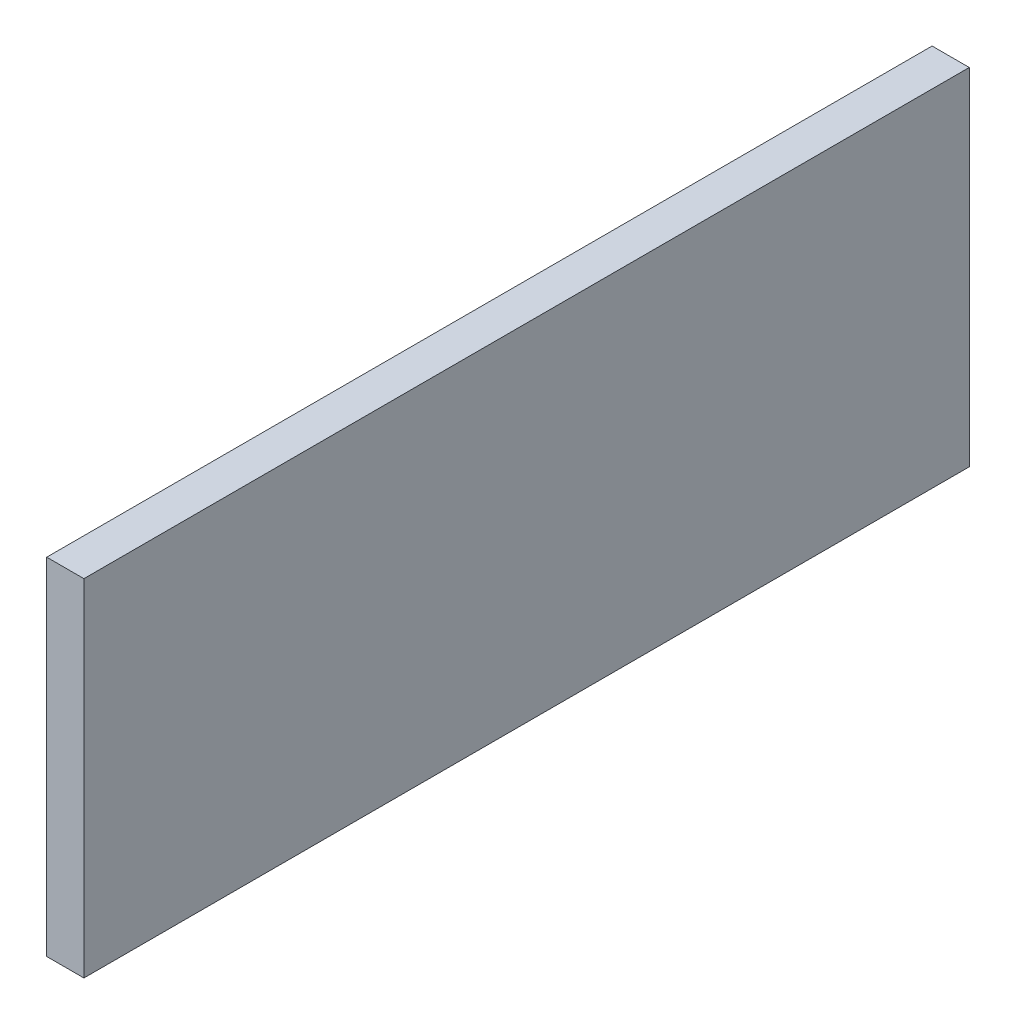
ISO-10303-21;
HEADER;
FILE_DESCRIPTION(('STEP AP214'),'2;1');
FILE_NAME('part.step','',(''),(''),'','','');
FILE_SCHEMA(('AUTOMOTIVE_DESIGN { 1 0 10303 214 1 1 1 1 }'));
ENDSEC;
DATA;
#1=APPLICATION_CONTEXT('core data for automotive mechanical design processes');
#2=APPLICATION_PROTOCOL_DEFINITION('international standard','automotive_design',2000,#1);
#3=PRODUCT_CONTEXT('',#1,'mechanical');
#4=PRODUCT('Part','Part','',(#3));
#5=PRODUCT_RELATED_PRODUCT_CATEGORY('part','',(#4));
#6=PRODUCT_DEFINITION_FORMATION('','',#4);
#7=PRODUCT_DEFINITION_CONTEXT('part definition',#1,'design');
#8=PRODUCT_DEFINITION('design','',#6,#7);
#9=PRODUCT_DEFINITION_SHAPE('','',#8);
#10=(LENGTH_UNIT() NAMED_UNIT(*) SI_UNIT(.MILLI.,.METRE.));
#11=(NAMED_UNIT(*) PLANE_ANGLE_UNIT() SI_UNIT($,.RADIAN.));
#12=(NAMED_UNIT(*) SI_UNIT($,.STERADIAN.) SOLID_ANGLE_UNIT());
#13=UNCERTAINTY_MEASURE_WITH_UNIT(LENGTH_MEASURE(1.E-05),#10,'distance_accuracy_value','');
#14=(GEOMETRIC_REPRESENTATION_CONTEXT(3) GLOBAL_UNCERTAINTY_ASSIGNED_CONTEXT((#13)) GLOBAL_UNIT_ASSIGNED_CONTEXT((#10,
#11,#12)) REPRESENTATION_CONTEXT('',''));
#15=CARTESIAN_POINT('',(0.,0.,0.));
#16=DIRECTION('',(0.,0.,1.));
#17=DIRECTION('',(1.,0.,0.));
#18=AXIS2_PLACEMENT_3D('',#15,#16,#17);
#19=CARTESIAN_POINT('',(1.5875,14.76,75.57));
#20=DIRECTION('',(-1.,0.,0.));
#21=DIRECTION('',(0.,-1.,0.));
#22=AXIS2_PLACEMENT_3D('',#19,#20,#21);
#23=PLANE('',#22);
#24=DIRECTION('',(0.,1.,0.));
#25=VECTOR('',#24,1.);
#26=CARTESIAN_POINT('',(1.5875,14.76,0.));
#27=LINE('',#26,#25);
#28=CARTESIAN_POINT('',(1.5875,-14.76,0.));
#29=VERTEX_POINT('',#28);
#30=CARTESIAN_POINT('',(1.5875,14.76,0.));
#31=VERTEX_POINT('',#30);
#32=EDGE_CURVE('E107',#29,#31,#27,.T.);
#33=ORIENTED_EDGE('',*,*,#32,.T.);
#34=DIRECTION('',(0.,0.,-1.));
#35=VECTOR('',#34,1.);
#36=CARTESIAN_POINT('',(1.5875,14.76,75.57));
#37=LINE('',#36,#35);
#38=CARTESIAN_POINT('',(1.5875,14.76,75.57));
#39=VERTEX_POINT('',#38);
#40=EDGE_CURVE('E11',#39,#31,#37,.T.);
#41=ORIENTED_EDGE('',*,*,#40,.F.);
#42=DIRECTION('',(0.,1.,0.));
#43=VECTOR('',#42,1.);
#44=CARTESIAN_POINT('',(1.5875,14.76,75.57));
#45=LINE('',#44,#43);
#46=CARTESIAN_POINT('',(1.5875,-14.76,75.57));
#47=VERTEX_POINT('',#46);
#48=EDGE_CURVE('E91',#47,#39,#45,.T.);
#49=ORIENTED_EDGE('',*,*,#48,.F.);
#50=DIRECTION('',(0.,0.,-1.));
#51=VECTOR('',#50,1.);
#52=CARTESIAN_POINT('',(1.5875,-14.76,75.57));
#53=LINE('',#52,#51);
#54=EDGE_CURVE('E103',#47,#29,#53,.T.);
#55=ORIENTED_EDGE('',*,*,#54,.T.);
#56=EDGE_LOOP('',(#33,#41,#49,#55));
#57=FACE_BOUND('',#56,.T.);
#58=ADVANCED_FACE('F39',(#57),#23,.F.);
#59=CARTESIAN_POINT('',(-1.5875,14.76,75.57));
#60=DIRECTION('',(0.,-1.,0.));
#61=DIRECTION('',(0.,0.,-1.));
#62=AXIS2_PLACEMENT_3D('',#59,#60,#61);
#63=PLANE('',#62);
#64=DIRECTION('',(-1.,0.,0.));
#65=VECTOR('',#64,1.);
#66=CARTESIAN_POINT('',(-1.5875,14.76,0.));
#67=LINE('',#66,#65);
#68=CARTESIAN_POINT('',(-1.5875,14.76,0.));
#69=VERTEX_POINT('',#68);
#70=EDGE_CURVE('E96',#31,#69,#67,.T.);
#71=ORIENTED_EDGE('',*,*,#70,.T.);
#72=DIRECTION('',(0.,0.,-1.));
#73=VECTOR('',#72,1.);
#74=CARTESIAN_POINT('',(-1.5875,14.76,75.57));
#75=LINE('',#74,#73);
#76=CARTESIAN_POINT('',(-1.5875,14.76,75.57));
#77=VERTEX_POINT('',#76);
#78=EDGE_CURVE('E48',#77,#69,#75,.T.);
#79=ORIENTED_EDGE('',*,*,#78,.F.);
#80=DIRECTION('',(-1.,0.,0.));
#81=VECTOR('',#80,1.);
#82=CARTESIAN_POINT('',(-1.5875,14.76,75.57));
#83=LINE('',#82,#81);
#84=EDGE_CURVE('E86',#39,#77,#83,.T.);
#85=ORIENTED_EDGE('',*,*,#84,.F.);
#86=ORIENTED_EDGE('',*,*,#40,.T.);
#87=EDGE_LOOP('',(#71,#79,#85,#86));
#88=FACE_BOUND('',#87,.T.);
#89=ADVANCED_FACE('F95',(#88),#63,.F.);
#90=CARTESIAN_POINT('',(-1.5875,14.76,75.57));
#91=DIRECTION('',(1.,0.,0.));
#92=DIRECTION('',(0.,1.,0.));
#93=AXIS2_PLACEMENT_3D('',#90,#91,#92);
#94=PLANE('',#93);
#95=DIRECTION('',(0.,-1.,0.));
#96=VECTOR('',#95,1.);
#97=CARTESIAN_POINT('',(-1.5875,14.76,0.));
#98=LINE('',#97,#96);
#99=CARTESIAN_POINT('',(-1.5875,-14.76,0.));
#100=VERTEX_POINT('',#99);
#101=EDGE_CURVE('E73',#69,#100,#98,.T.);
#102=ORIENTED_EDGE('',*,*,#101,.T.);
#103=DIRECTION('',(0.,0.,-1.));
#104=VECTOR('',#103,1.);
#105=CARTESIAN_POINT('',(-1.5875,-14.76,75.57));
#106=LINE('',#105,#104);
#107=CARTESIAN_POINT('',(-1.5875,-14.76,75.57));
#108=VERTEX_POINT('',#107);
#109=EDGE_CURVE('E98',#108,#100,#106,.T.);
#110=ORIENTED_EDGE('',*,*,#109,.F.);
#111=DIRECTION('',(0.,-1.,0.));
#112=VECTOR('',#111,1.);
#113=CARTESIAN_POINT('',(-1.5875,14.76,75.57));
#114=LINE('',#113,#112);
#115=EDGE_CURVE('E89',#77,#108,#114,.T.);
#116=ORIENTED_EDGE('',*,*,#115,.F.);
#117=ORIENTED_EDGE('',*,*,#78,.T.);
#118=EDGE_LOOP('',(#102,#110,#116,#117));
#119=FACE_BOUND('',#118,.T.);
#120=ADVANCED_FACE('F99',(#119),#94,.F.);
#121=CARTESIAN_POINT('',(-1.5875,-14.76,75.57));
#122=DIRECTION('',(0.,1.,0.));
#123=DIRECTION('',(0.,0.,1.));
#124=AXIS2_PLACEMENT_3D('',#121,#122,#123);
#125=PLANE('',#124);
#126=DIRECTION('',(1.,0.,0.));
#127=VECTOR('',#126,1.);
#128=CARTESIAN_POINT('',(-1.5875,-14.76,0.));
#129=LINE('',#128,#127);
#130=EDGE_CURVE('E79',#100,#29,#129,.T.);
#131=ORIENTED_EDGE('',*,*,#130,.T.);
#132=ORIENTED_EDGE('',*,*,#54,.F.);
#133=DIRECTION('',(1.,0.,0.));
#134=VECTOR('',#133,1.);
#135=CARTESIAN_POINT('',(-1.5875,-14.76,75.57));
#136=LINE('',#135,#134);
#137=EDGE_CURVE('E56',#108,#47,#136,.T.);
#138=ORIENTED_EDGE('',*,*,#137,.F.);
#139=ORIENTED_EDGE('',*,*,#109,.T.);
#140=EDGE_LOOP('',(#131,#132,#138,#139));
#141=FACE_BOUND('',#140,.T.);
#142=ADVANCED_FACE('F120',(#141),#125,.F.);
#143=CARTESIAN_POINT('',(0.,0.,75.57));
#144=DIRECTION('',(0.,0.,1.));
#145=DIRECTION('',(1.,0.,0.));
#146=AXIS2_PLACEMENT_3D('',#143,#144,#145);
#147=PLANE('',#146);
#148=ORIENTED_EDGE('',*,*,#48,.T.);
#149=ORIENTED_EDGE('',*,*,#84,.T.);
#150=ORIENTED_EDGE('',*,*,#115,.T.);
#151=ORIENTED_EDGE('',*,*,#137,.T.);
#152=EDGE_LOOP('',(#148,#149,#150,#151));
#153=FACE_BOUND('',#152,.T.);
#154=ADVANCED_FACE('F87',(#153),#147,.T.);
#155=CARTESIAN_POINT('',(0.,0.,0.));
#156=DIRECTION('',(0.,0.,1.));
#157=DIRECTION('',(1.,0.,0.));
#158=AXIS2_PLACEMENT_3D('',#155,#156,#157);
#159=PLANE('',#158);
#160=ORIENTED_EDGE('',*,*,#32,.F.);
#161=ORIENTED_EDGE('',*,*,#130,.F.);
#162=ORIENTED_EDGE('',*,*,#101,.F.);
#163=ORIENTED_EDGE('',*,*,#70,.F.);
#164=EDGE_LOOP('',(#160,#161,#162,#163));
#165=FACE_BOUND('',#164,.T.);
#166=ADVANCED_FACE('F123',(#165),#159,.F.);
#167=CLOSED_SHELL('',(#58,#89,#120,#142,#154,#166));
#168=MANIFOLD_SOLID_BREP('B2',#167);
#169=ADVANCED_BREP_SHAPE_REPRESENTATION('',(#18,#168),#14);
#170=SHAPE_DEFINITION_REPRESENTATION(#9,#169);
ENDSEC;
END-ISO-10303-21;
